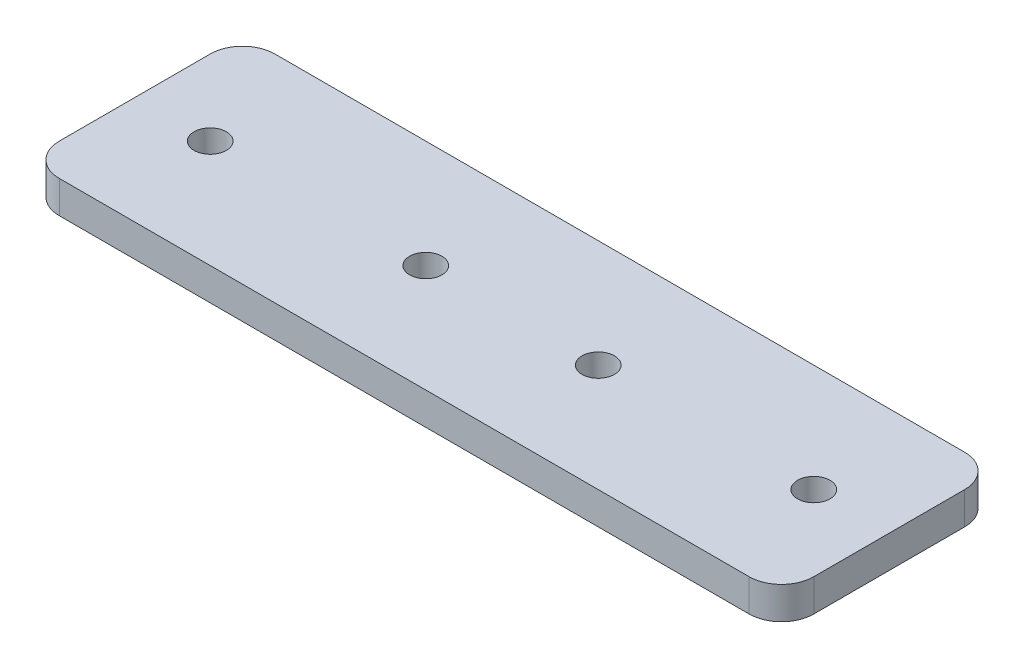
ISO-10303-21;
HEADER;
FILE_DESCRIPTION(('STEP AP214'),'2;1');
FILE_NAME('part.step','',(''),(''),'','','');
FILE_SCHEMA(('AUTOMOTIVE_DESIGN { 1 0 10303 214 1 1 1 1 }'));
ENDSEC;
DATA;
#1=APPLICATION_CONTEXT('core data for automotive mechanical design processes');
#2=APPLICATION_PROTOCOL_DEFINITION('international standard','automotive_design',2000,#1);
#3=PRODUCT_CONTEXT('',#1,'mechanical');
#4=PRODUCT('Part','Part','',(#3));
#5=PRODUCT_RELATED_PRODUCT_CATEGORY('part','',(#4));
#6=PRODUCT_DEFINITION_FORMATION('','',#4);
#7=PRODUCT_DEFINITION_CONTEXT('part definition',#1,'design');
#8=PRODUCT_DEFINITION('design','',#6,#7);
#9=PRODUCT_DEFINITION_SHAPE('','',#8);
#10=(LENGTH_UNIT() NAMED_UNIT(*) SI_UNIT(.MILLI.,.METRE.));
#11=(NAMED_UNIT(*) PLANE_ANGLE_UNIT() SI_UNIT($,.RADIAN.));
#12=(NAMED_UNIT(*) SI_UNIT($,.STERADIAN.) SOLID_ANGLE_UNIT());
#13=UNCERTAINTY_MEASURE_WITH_UNIT(LENGTH_MEASURE(1.E-05),#10,'distance_accuracy_value','');
#14=(GEOMETRIC_REPRESENTATION_CONTEXT(3) GLOBAL_UNCERTAINTY_ASSIGNED_CONTEXT((#13)) GLOBAL_UNIT_ASSIGNED_CONTEXT((#10,
#11,#12)) REPRESENTATION_CONTEXT('',''));
#15=CARTESIAN_POINT('',(0.,0.,0.));
#16=DIRECTION('',(0.,0.,1.));
#17=DIRECTION('',(1.,0.,0.));
#18=AXIS2_PLACEMENT_3D('',#15,#16,#17);
#19=CARTESIAN_POINT('',(32.,3.,-7.));
#20=DIRECTION('',(0.,1.,0.));
#21=DIRECTION('',(0.,0.,1.));
#22=AXIS2_PLACEMENT_3D('',#19,#20,#21);
#23=PLANE('',#22);
#24=CARTESIAN_POINT('',(28.,3.,0.));
#25=DIRECTION('',(0.,1.,0.));
#26=DIRECTION('',(0.,0.,1.));
#27=AXIS2_PLACEMENT_3D('',#24,#25,#26);
#28=CIRCLE('',#27,1.5);
#29=CARTESIAN_POINT('',(28.,3.,1.5));
#30=VERTEX_POINT('',#29);
#31=EDGE_CURVE('E187',#30,#30,#28,.T.);
#32=ORIENTED_EDGE('',*,*,#31,.F.);
#33=EDGE_LOOP('',(#32));
#34=FACE_BOUND('',#33,.T.);
#35=CARTESIAN_POINT('',(8.,3.,0.));
#36=DIRECTION('',(0.,1.,0.));
#37=DIRECTION('',(0.,0.,1.));
#38=AXIS2_PLACEMENT_3D('',#35,#36,#37);
#39=CIRCLE('',#38,1.5);
#40=CARTESIAN_POINT('',(8.,3.,1.5));
#41=VERTEX_POINT('',#40);
#42=EDGE_CURVE('E133',#41,#41,#39,.T.);
#43=ORIENTED_EDGE('',*,*,#42,.F.);
#44=EDGE_LOOP('',(#43));
#45=FACE_BOUND('',#44,.T.);
#46=CARTESIAN_POINT('',(32.,3.,-7.));
#47=DIRECTION('',(0.,1.,0.));
#48=DIRECTION('',(0.,0.,1.));
#49=AXIS2_PLACEMENT_3D('',#46,#47,#48);
#50=CIRCLE('',#49,3.);
#51=CARTESIAN_POINT('',(35.,3.,-6.99999999999998));
#52=VERTEX_POINT('',#51);
#53=CARTESIAN_POINT('',(32.,3.,-10.));
#54=VERTEX_POINT('',#53);
#55=EDGE_CURVE('E144',#52,#54,#50,.T.);
#56=ORIENTED_EDGE('',*,*,#55,.T.);
#57=DIRECTION('',(-1.,0.,0.));
#58=VECTOR('',#57,1.);
#59=CARTESIAN_POINT('',(-32.,3.,-10.));
#60=LINE('',#59,#58);
#61=CARTESIAN_POINT('',(-32.,3.,-10.));
#62=VERTEX_POINT('',#61);
#63=EDGE_CURVE('E92',#54,#62,#60,.T.);
#64=ORIENTED_EDGE('',*,*,#63,.T.);
#65=CARTESIAN_POINT('',(-32.,3.,-7.));
#66=DIRECTION('',(0.,1.,0.));
#67=DIRECTION('',(0.,0.,-1.));
#68=AXIS2_PLACEMENT_3D('',#65,#66,#67);
#69=CIRCLE('',#68,3.);
#70=CARTESIAN_POINT('',(-35.,3.,-6.99999999999998));
#71=VERTEX_POINT('',#70);
#72=EDGE_CURVE('E159',#62,#71,#69,.T.);
#73=ORIENTED_EDGE('',*,*,#72,.T.);
#74=DIRECTION('',(0.,0.,1.));
#75=VECTOR('',#74,1.);
#76=CARTESIAN_POINT('',(-35.,3.,-6.99999999999998));
#77=LINE('',#76,#75);
#78=CARTESIAN_POINT('',(-35.,3.,6.99999999999998));
#79=VERTEX_POINT('',#78);
#80=EDGE_CURVE('E172',#71,#79,#77,.T.);
#81=ORIENTED_EDGE('',*,*,#80,.T.);
#82=CARTESIAN_POINT('',(-32.,3.,7.));
#83=DIRECTION('',(0.,1.,0.));
#84=DIRECTION('',(0.,0.,1.));
#85=AXIS2_PLACEMENT_3D('',#82,#83,#84);
#86=CIRCLE('',#85,3.);
#87=CARTESIAN_POINT('',(-32.,3.,10.));
#88=VERTEX_POINT('',#87);
#89=EDGE_CURVE('E111',#79,#88,#86,.T.);
#90=ORIENTED_EDGE('',*,*,#89,.T.);
#91=DIRECTION('',(1.,0.,0.));
#92=VECTOR('',#91,1.);
#93=CARTESIAN_POINT('',(-32.,3.,10.));
#94=LINE('',#93,#92);
#95=CARTESIAN_POINT('',(32.,3.,10.));
#96=VERTEX_POINT('',#95);
#97=EDGE_CURVE('E105',#88,#96,#94,.T.);
#98=ORIENTED_EDGE('',*,*,#97,.T.);
#99=CARTESIAN_POINT('',(32.,3.,7.));
#100=DIRECTION('',(0.,1.,0.));
#101=DIRECTION('',(0.,0.,-1.));
#102=AXIS2_PLACEMENT_3D('',#99,#100,#101);
#103=CIRCLE('',#102,3.);
#104=CARTESIAN_POINT('',(35.,3.,6.99999999999998));
#105=VERTEX_POINT('',#104);
#106=EDGE_CURVE('E109',#96,#105,#103,.T.);
#107=ORIENTED_EDGE('',*,*,#106,.T.);
#108=DIRECTION('',(0.,0.,-1.));
#109=VECTOR('',#108,1.);
#110=CARTESIAN_POINT('',(35.,3.,-6.99999999999998));
#111=LINE('',#110,#109);
#112=EDGE_CURVE('E49',#105,#52,#111,.T.);
#113=ORIENTED_EDGE('',*,*,#112,.T.);
#114=EDGE_LOOP('',(#56,#64,#73,#81,#90,#98,#107,#113));
#115=FACE_BOUND('',#114,.T.);
#116=CARTESIAN_POINT('',(-8.,3.,0.));
#117=DIRECTION('',(0.,1.,0.));
#118=DIRECTION('',(0.,0.,1.));
#119=AXIS2_PLACEMENT_3D('',#116,#117,#118);
#120=CIRCLE('',#119,1.5);
#121=CARTESIAN_POINT('',(-8.,3.,1.5));
#122=VERTEX_POINT('',#121);
#123=EDGE_CURVE('E181',#122,#122,#120,.T.);
#124=ORIENTED_EDGE('',*,*,#123,.F.);
#125=EDGE_LOOP('',(#124));
#126=FACE_BOUND('',#125,.T.);
#127=CARTESIAN_POINT('',(-28.,3.,0.));
#128=DIRECTION('',(0.,1.,0.));
#129=DIRECTION('',(0.,0.,1.));
#130=AXIS2_PLACEMENT_3D('',#127,#128,#129);
#131=CIRCLE('',#130,1.5);
#132=CARTESIAN_POINT('',(-28.,3.,1.5));
#133=VERTEX_POINT('',#132);
#134=EDGE_CURVE('E193',#133,#133,#131,.T.);
#135=ORIENTED_EDGE('',*,*,#134,.F.);
#136=EDGE_LOOP('',(#135));
#137=FACE_BOUND('',#136,.T.);
#138=ADVANCED_FACE('F32',(#34,#45,#115,#126,#137),#23,.T.);
#139=CARTESIAN_POINT('',(32.,0.,-7.));
#140=DIRECTION('',(0.,1.,0.));
#141=DIRECTION('',(0.,0.,1.));
#142=AXIS2_PLACEMENT_3D('',#139,#140,#141);
#143=PLANE('',#142);
#144=CARTESIAN_POINT('',(32.,0.,-7.));
#145=DIRECTION('',(0.,1.,0.));
#146=DIRECTION('',(0.,0.,1.));
#147=AXIS2_PLACEMENT_3D('',#144,#145,#146);
#148=CIRCLE('',#147,3.);
#149=CARTESIAN_POINT('',(35.,0.,-6.99999999999998));
#150=VERTEX_POINT('',#149);
#151=CARTESIAN_POINT('',(32.,0.,-10.));
#152=VERTEX_POINT('',#151);
#153=EDGE_CURVE('E129',#150,#152,#148,.T.);
#154=ORIENTED_EDGE('',*,*,#153,.F.);
#155=DIRECTION('',(0.,0.,-1.));
#156=VECTOR('',#155,1.);
#157=CARTESIAN_POINT('',(35.,0.,-6.99999999999998));
#158=LINE('',#157,#156);
#159=CARTESIAN_POINT('',(35.,0.,6.99999999999998));
#160=VERTEX_POINT('',#159);
#161=EDGE_CURVE('E84',#160,#150,#158,.T.);
#162=ORIENTED_EDGE('',*,*,#161,.F.);
#163=CARTESIAN_POINT('',(32.,0.,7.));
#164=DIRECTION('',(0.,1.,0.));
#165=DIRECTION('',(0.,0.,-1.));
#166=AXIS2_PLACEMENT_3D('',#163,#164,#165);
#167=CIRCLE('',#166,3.);
#168=CARTESIAN_POINT('',(32.,0.,10.));
#169=VERTEX_POINT('',#168);
#170=EDGE_CURVE('E78',#169,#160,#167,.T.);
#171=ORIENTED_EDGE('',*,*,#170,.F.);
#172=DIRECTION('',(1.,0.,0.));
#173=VECTOR('',#172,1.);
#174=CARTESIAN_POINT('',(-32.,0.,10.));
#175=LINE('',#174,#173);
#176=CARTESIAN_POINT('',(-32.,0.,10.));
#177=VERTEX_POINT('',#176);
#178=EDGE_CURVE('E119',#177,#169,#175,.T.);
#179=ORIENTED_EDGE('',*,*,#178,.F.);
#180=CARTESIAN_POINT('',(-32.,0.,7.));
#181=DIRECTION('',(0.,1.,0.));
#182=DIRECTION('',(0.,0.,1.));
#183=AXIS2_PLACEMENT_3D('',#180,#181,#182);
#184=CIRCLE('',#183,3.);
#185=CARTESIAN_POINT('',(-35.,0.,6.99999999999998));
#186=VERTEX_POINT('',#185);
#187=EDGE_CURVE('E139',#186,#177,#184,.T.);
#188=ORIENTED_EDGE('',*,*,#187,.F.);
#189=DIRECTION('',(0.,0.,1.));
#190=VECTOR('',#189,1.);
#191=CARTESIAN_POINT('',(-35.,0.,-6.99999999999998));
#192=LINE('',#191,#190);
#193=CARTESIAN_POINT('',(-35.,0.,-6.99999999999998));
#194=VERTEX_POINT('',#193);
#195=EDGE_CURVE('E137',#194,#186,#192,.T.);
#196=ORIENTED_EDGE('',*,*,#195,.F.);
#197=CARTESIAN_POINT('',(-32.,0.,-7.));
#198=DIRECTION('',(0.,1.,0.));
#199=DIRECTION('',(0.,0.,-1.));
#200=AXIS2_PLACEMENT_3D('',#197,#198,#199);
#201=CIRCLE('',#200,3.);
#202=CARTESIAN_POINT('',(-32.,0.,-10.));
#203=VERTEX_POINT('',#202);
#204=EDGE_CURVE('E135',#203,#194,#201,.T.);
#205=ORIENTED_EDGE('',*,*,#204,.F.);
#206=DIRECTION('',(-1.,0.,0.));
#207=VECTOR('',#206,1.);
#208=CARTESIAN_POINT('',(-32.,0.,-10.));
#209=LINE('',#208,#207);
#210=EDGE_CURVE('E132',#152,#203,#209,.T.);
#211=ORIENTED_EDGE('',*,*,#210,.F.);
#212=EDGE_LOOP('',(#154,#162,#171,#179,#188,#196,#205,#211));
#213=FACE_BOUND('',#212,.T.);
#214=CARTESIAN_POINT('',(8.,0.,0.));
#215=DIRECTION('',(0.,1.,0.));
#216=DIRECTION('',(0.,0.,1.));
#217=AXIS2_PLACEMENT_3D('',#214,#215,#216);
#218=CIRCLE('',#217,1.5);
#219=CARTESIAN_POINT('',(8.,0.,1.5));
#220=VERTEX_POINT('',#219);
#221=EDGE_CURVE('E178',#220,#220,#218,.T.);
#222=ORIENTED_EDGE('',*,*,#221,.T.);
#223=EDGE_LOOP('',(#222));
#224=FACE_BOUND('',#223,.T.);
#225=CARTESIAN_POINT('',(-8.,0.,0.));
#226=DIRECTION('',(0.,1.,0.));
#227=DIRECTION('',(0.,0.,1.));
#228=AXIS2_PLACEMENT_3D('',#225,#226,#227);
#229=CIRCLE('',#228,1.5);
#230=CARTESIAN_POINT('',(-8.,0.,1.5));
#231=VERTEX_POINT('',#230);
#232=EDGE_CURVE('E184',#231,#231,#229,.T.);
#233=ORIENTED_EDGE('',*,*,#232,.T.);
#234=EDGE_LOOP('',(#233));
#235=FACE_BOUND('',#234,.T.);
#236=CARTESIAN_POINT('',(28.,0.,0.));
#237=DIRECTION('',(0.,1.,0.));
#238=DIRECTION('',(0.,0.,1.));
#239=AXIS2_PLACEMENT_3D('',#236,#237,#238);
#240=CIRCLE('',#239,1.5);
#241=CARTESIAN_POINT('',(28.,0.,1.5));
#242=VERTEX_POINT('',#241);
#243=EDGE_CURVE('E190',#242,#242,#240,.T.);
#244=ORIENTED_EDGE('',*,*,#243,.T.);
#245=EDGE_LOOP('',(#244));
#246=FACE_BOUND('',#245,.T.);
#247=CARTESIAN_POINT('',(-28.,0.,0.));
#248=DIRECTION('',(0.,1.,0.));
#249=DIRECTION('',(0.,0.,1.));
#250=AXIS2_PLACEMENT_3D('',#247,#248,#249);
#251=CIRCLE('',#250,1.5);
#252=CARTESIAN_POINT('',(-28.,0.,1.5));
#253=VERTEX_POINT('',#252);
#254=EDGE_CURVE('E196',#253,#253,#251,.T.);
#255=ORIENTED_EDGE('',*,*,#254,.T.);
#256=EDGE_LOOP('',(#255));
#257=FACE_BOUND('',#256,.T.);
#258=ADVANCED_FACE('F163',(#213,#224,#235,#246,#257),#143,.F.);
#259=CARTESIAN_POINT('',(32.,3.,-7.));
#260=DIRECTION('',(0.,-1.,0.));
#261=DIRECTION('',(0.,0.,-1.));
#262=AXIS2_PLACEMENT_3D('',#259,#260,#261);
#263=CYLINDRICAL_SURFACE('',#262,3.);
#264=ORIENTED_EDGE('',*,*,#153,.T.);
#265=DIRECTION('',(0.,-1.,0.));
#266=VECTOR('',#265,1.);
#267=CARTESIAN_POINT('',(32.,3.,-10.));
#268=LINE('',#267,#266);
#269=EDGE_CURVE('E11',#54,#152,#268,.T.);
#270=ORIENTED_EDGE('',*,*,#269,.F.);
#271=ORIENTED_EDGE('',*,*,#55,.F.);
#272=DIRECTION('',(0.,-1.,0.));
#273=VECTOR('',#272,1.);
#274=CARTESIAN_POINT('',(35.,3.,-6.99999999999998));
#275=LINE('',#274,#273);
#276=EDGE_CURVE('E125',#52,#150,#275,.T.);
#277=ORIENTED_EDGE('',*,*,#276,.T.);
#278=EDGE_LOOP('',(#264,#270,#271,#277));
#279=FACE_BOUND('',#278,.T.);
#280=ADVANCED_FACE('F34',(#279),#263,.T.);
#281=CARTESIAN_POINT('',(-32.,3.,-10.));
#282=DIRECTION('',(0.,0.,1.));
#283=DIRECTION('',(1.,0.,0.));
#284=AXIS2_PLACEMENT_3D('',#281,#282,#283);
#285=PLANE('',#284);
#286=ORIENTED_EDGE('',*,*,#210,.T.);
#287=DIRECTION('',(0.,-1.,0.));
#288=VECTOR('',#287,1.);
#289=CARTESIAN_POINT('',(-32.,3.,-10.));
#290=LINE('',#289,#288);
#291=EDGE_CURVE('E41',#62,#203,#290,.T.);
#292=ORIENTED_EDGE('',*,*,#291,.F.);
#293=ORIENTED_EDGE('',*,*,#63,.F.);
#294=ORIENTED_EDGE('',*,*,#269,.T.);
#295=EDGE_LOOP('',(#286,#292,#293,#294));
#296=FACE_BOUND('',#295,.T.);
#297=ADVANCED_FACE('F230',(#296),#285,.F.);
#298=CARTESIAN_POINT('',(-32.,3.,-7.));
#299=DIRECTION('',(0.,-1.,0.));
#300=DIRECTION('',(0.,0.,-1.));
#301=AXIS2_PLACEMENT_3D('',#298,#299,#300);
#302=CYLINDRICAL_SURFACE('',#301,3.);
#303=ORIENTED_EDGE('',*,*,#204,.T.);
#304=DIRECTION('',(0.,-1.,0.));
#305=VECTOR('',#304,1.);
#306=CARTESIAN_POINT('',(-35.,3.,-6.99999999999998));
#307=LINE('',#306,#305);
#308=EDGE_CURVE('E151',#71,#194,#307,.T.);
#309=ORIENTED_EDGE('',*,*,#308,.F.);
#310=ORIENTED_EDGE('',*,*,#72,.F.);
#311=ORIENTED_EDGE('',*,*,#291,.T.);
#312=EDGE_LOOP('',(#303,#309,#310,#311));
#313=FACE_BOUND('',#312,.T.);
#314=ADVANCED_FACE('F157',(#313),#302,.T.);
#315=CARTESIAN_POINT('',(-35.,3.,-6.99999999999998));
#316=DIRECTION('',(1.,0.,0.));
#317=DIRECTION('',(0.,0.,-1.));
#318=AXIS2_PLACEMENT_3D('',#315,#316,#317);
#319=PLANE('',#318);
#320=ORIENTED_EDGE('',*,*,#195,.T.);
#321=DIRECTION('',(0.,-1.,0.));
#322=VECTOR('',#321,1.);
#323=CARTESIAN_POINT('',(-35.,3.,6.99999999999998));
#324=LINE('',#323,#322);
#325=EDGE_CURVE('E148',#79,#186,#324,.T.);
#326=ORIENTED_EDGE('',*,*,#325,.F.);
#327=ORIENTED_EDGE('',*,*,#80,.F.);
#328=ORIENTED_EDGE('',*,*,#308,.T.);
#329=EDGE_LOOP('',(#320,#326,#327,#328));
#330=FACE_BOUND('',#329,.T.);
#331=ADVANCED_FACE('F168',(#330),#319,.F.);
#332=CARTESIAN_POINT('',(-32.,3.,7.));
#333=DIRECTION('',(0.,-1.,0.));
#334=DIRECTION('',(0.,0.,-1.));
#335=AXIS2_PLACEMENT_3D('',#332,#333,#334);
#336=CYLINDRICAL_SURFACE('',#335,3.);
#337=ORIENTED_EDGE('',*,*,#187,.T.);
#338=DIRECTION('',(0.,-1.,0.));
#339=VECTOR('',#338,1.);
#340=CARTESIAN_POINT('',(-32.,3.,10.));
#341=LINE('',#340,#339);
#342=EDGE_CURVE('E120',#88,#177,#341,.T.);
#343=ORIENTED_EDGE('',*,*,#342,.F.);
#344=ORIENTED_EDGE('',*,*,#89,.F.);
#345=ORIENTED_EDGE('',*,*,#325,.T.);
#346=EDGE_LOOP('',(#337,#343,#344,#345));
#347=FACE_BOUND('',#346,.T.);
#348=ADVANCED_FACE('F171',(#347),#336,.T.);
#349=CARTESIAN_POINT('',(-32.,3.,10.));
#350=DIRECTION('',(0.,0.,-1.));
#351=DIRECTION('',(-1.,0.,0.));
#352=AXIS2_PLACEMENT_3D('',#349,#350,#351);
#353=PLANE('',#352);
#354=ORIENTED_EDGE('',*,*,#178,.T.);
#355=DIRECTION('',(0.,-1.,0.));
#356=VECTOR('',#355,1.);
#357=CARTESIAN_POINT('',(32.,3.,10.));
#358=LINE('',#357,#356);
#359=EDGE_CURVE('E116',#96,#169,#358,.T.);
#360=ORIENTED_EDGE('',*,*,#359,.F.);
#361=ORIENTED_EDGE('',*,*,#97,.F.);
#362=ORIENTED_EDGE('',*,*,#342,.T.);
#363=EDGE_LOOP('',(#354,#360,#361,#362));
#364=FACE_BOUND('',#363,.T.);
#365=ADVANCED_FACE('F117',(#364),#353,.F.);
#366=CARTESIAN_POINT('',(32.,3.,7.));
#367=DIRECTION('',(0.,-1.,0.));
#368=DIRECTION('',(0.,0.,-1.));
#369=AXIS2_PLACEMENT_3D('',#366,#367,#368);
#370=CYLINDRICAL_SURFACE('',#369,3.);
#371=ORIENTED_EDGE('',*,*,#170,.T.);
#372=DIRECTION('',(0.,-1.,0.));
#373=VECTOR('',#372,1.);
#374=CARTESIAN_POINT('',(35.,3.,6.99999999999998));
#375=LINE('',#374,#373);
#376=EDGE_CURVE('E121',#105,#160,#375,.T.);
#377=ORIENTED_EDGE('',*,*,#376,.F.);
#378=ORIENTED_EDGE('',*,*,#106,.F.);
#379=ORIENTED_EDGE('',*,*,#359,.T.);
#380=EDGE_LOOP('',(#371,#377,#378,#379));
#381=FACE_BOUND('',#380,.T.);
#382=ADVANCED_FACE('F123',(#381),#370,.T.);
#383=CARTESIAN_POINT('',(35.,3.,-6.99999999999998));
#384=DIRECTION('',(-1.,0.,0.));
#385=DIRECTION('',(0.,0.,1.));
#386=AXIS2_PLACEMENT_3D('',#383,#384,#385);
#387=PLANE('',#386);
#388=ORIENTED_EDGE('',*,*,#161,.T.);
#389=ORIENTED_EDGE('',*,*,#276,.F.);
#390=ORIENTED_EDGE('',*,*,#112,.F.);
#391=ORIENTED_EDGE('',*,*,#376,.T.);
#392=EDGE_LOOP('',(#388,#389,#390,#391));
#393=FACE_BOUND('',#392,.T.);
#394=ADVANCED_FACE('F218',(#393),#387,.F.);
#395=CARTESIAN_POINT('',(8.,3.,0.));
#396=DIRECTION('',(0.,-1.,0.));
#397=DIRECTION('',(0.,0.,-1.));
#398=AXIS2_PLACEMENT_3D('',#395,#396,#397);
#399=CYLINDRICAL_SURFACE('',#398,1.5);
#400=ORIENTED_EDGE('',*,*,#42,.T.);
#401=EDGE_LOOP('',(#400));
#402=FACE_BOUND('',#401,.T.);
#403=ORIENTED_EDGE('',*,*,#221,.F.);
#404=EDGE_LOOP('',(#403));
#405=FACE_BOUND('',#404,.T.);
#406=ADVANCED_FACE('F215',(#402,#405),#399,.F.);
#407=CARTESIAN_POINT('',(-8.,3.,0.));
#408=DIRECTION('',(0.,-1.,0.));
#409=DIRECTION('',(0.,0.,-1.));
#410=AXIS2_PLACEMENT_3D('',#407,#408,#409);
#411=CYLINDRICAL_SURFACE('',#410,1.5);
#412=ORIENTED_EDGE('',*,*,#123,.T.);
#413=EDGE_LOOP('',(#412));
#414=FACE_BOUND('',#413,.T.);
#415=ORIENTED_EDGE('',*,*,#232,.F.);
#416=EDGE_LOOP('',(#415));
#417=FACE_BOUND('',#416,.T.);
#418=ADVANCED_FACE('F294',(#414,#417),#411,.F.);
#419=CARTESIAN_POINT('',(28.,3.,0.));
#420=DIRECTION('',(0.,-1.,0.));
#421=DIRECTION('',(0.,0.,-1.));
#422=AXIS2_PLACEMENT_3D('',#419,#420,#421);
#423=CYLINDRICAL_SURFACE('',#422,1.5);
#424=ORIENTED_EDGE('',*,*,#31,.T.);
#425=EDGE_LOOP('',(#424));
#426=FACE_BOUND('',#425,.T.);
#427=ORIENTED_EDGE('',*,*,#243,.F.);
#428=EDGE_LOOP('',(#427));
#429=FACE_BOUND('',#428,.T.);
#430=ADVANCED_FACE('F302',(#426,#429),#423,.F.);
#431=CARTESIAN_POINT('',(-28.,3.,0.));
#432=DIRECTION('',(0.,-1.,0.));
#433=DIRECTION('',(0.,0.,-1.));
#434=AXIS2_PLACEMENT_3D('',#431,#432,#433);
#435=CYLINDRICAL_SURFACE('',#434,1.5);
#436=ORIENTED_EDGE('',*,*,#134,.T.);
#437=EDGE_LOOP('',(#436));
#438=FACE_BOUND('',#437,.T.);
#439=ORIENTED_EDGE('',*,*,#254,.F.);
#440=EDGE_LOOP('',(#439));
#441=FACE_BOUND('',#440,.T.);
#442=ADVANCED_FACE('F202',(#438,#441),#435,.F.);
#443=CLOSED_SHELL('',(#138,#258,#280,#297,#314,#331,#348,#365,#382,#394,#406,#418,#430,#442));
#444=MANIFOLD_SOLID_BREP('B2',#443);
#445=ADVANCED_BREP_SHAPE_REPRESENTATION('',(#18,#444),#14);
#446=SHAPE_DEFINITION_REPRESENTATION(#9,#445);
ENDSEC;
END-ISO-10303-21;
